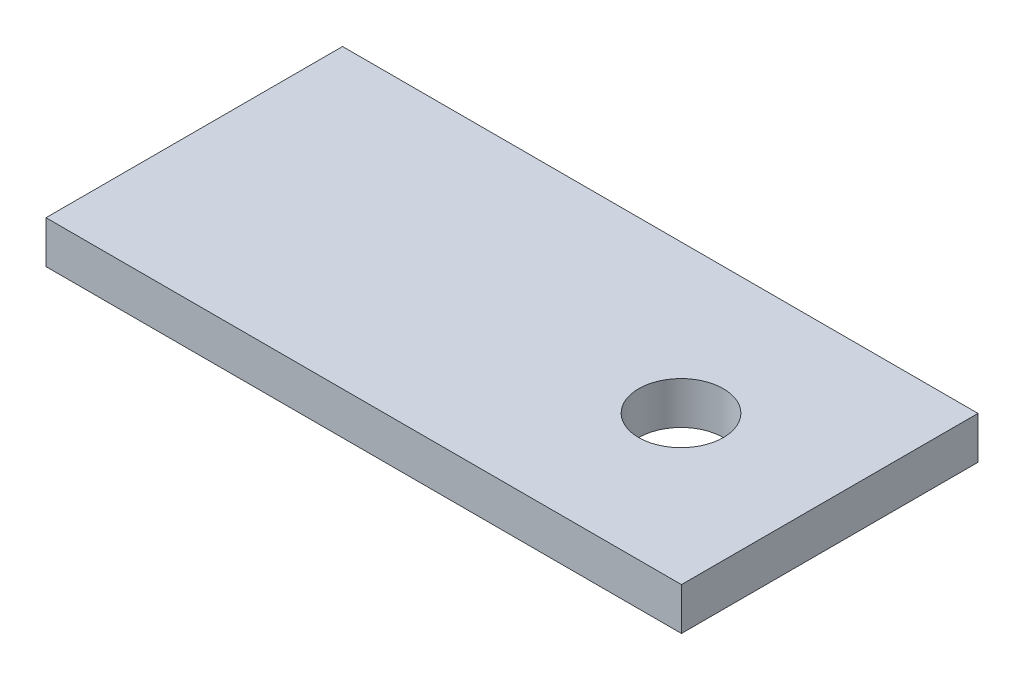
ISO-10303-21;
HEADER;
FILE_DESCRIPTION(('STEP AP214'),'2;1');
FILE_NAME('part.step','',(''),(''),'','','');
FILE_SCHEMA(('AUTOMOTIVE_DESIGN { 1 0 10303 214 1 1 1 1 }'));
ENDSEC;
DATA;
#1=APPLICATION_CONTEXT('core data for automotive mechanical design processes');
#2=APPLICATION_PROTOCOL_DEFINITION('international standard','automotive_design',2000,#1);
#3=PRODUCT_CONTEXT('',#1,'mechanical');
#4=PRODUCT('Part','Part','',(#3));
#5=PRODUCT_RELATED_PRODUCT_CATEGORY('part','',(#4));
#6=PRODUCT_DEFINITION_FORMATION('','',#4);
#7=PRODUCT_DEFINITION_CONTEXT('part definition',#1,'design');
#8=PRODUCT_DEFINITION('design','',#6,#7);
#9=PRODUCT_DEFINITION_SHAPE('','',#8);
#10=(LENGTH_UNIT() NAMED_UNIT(*) SI_UNIT(.MILLI.,.METRE.));
#11=(NAMED_UNIT(*) PLANE_ANGLE_UNIT() SI_UNIT($,.RADIAN.));
#12=(NAMED_UNIT(*) SI_UNIT($,.STERADIAN.) SOLID_ANGLE_UNIT());
#13=UNCERTAINTY_MEASURE_WITH_UNIT(LENGTH_MEASURE(1.E-05),#10,'distance_accuracy_value','');
#14=(GEOMETRIC_REPRESENTATION_CONTEXT(3) GLOBAL_UNCERTAINTY_ASSIGNED_CONTEXT((#13)) GLOBAL_UNIT_ASSIGNED_CONTEXT((#10,
#11,#12)) REPRESENTATION_CONTEXT('',''));
#15=CARTESIAN_POINT('',(0.,0.,0.));
#16=DIRECTION('',(0.,0.,1.));
#17=DIRECTION('',(1.,0.,0.));
#18=AXIS2_PLACEMENT_3D('',#15,#16,#17);
#19=CARTESIAN_POINT('',(0.,2.,0.));
#20=DIRECTION('',(-1.,0.,0.));
#21=DIRECTION('',(0.,0.,1.));
#22=AXIS2_PLACEMENT_3D('',#19,#20,#21);
#23=PLANE('',#22);
#24=DIRECTION('',(0.,0.,-1.));
#25=VECTOR('',#24,1.);
#26=CARTESIAN_POINT('',(0.,0.,0.));
#27=LINE('',#26,#25);
#28=CARTESIAN_POINT('',(0.,0.,0.));
#29=VERTEX_POINT('',#28);
#30=CARTESIAN_POINT('',(0.,0.,-14.));
#31=VERTEX_POINT('',#30);
#32=EDGE_CURVE('E101',#29,#31,#27,.T.);
#33=ORIENTED_EDGE('',*,*,#32,.T.);
#34=DIRECTION('',(0.,-1.,0.));
#35=VECTOR('',#34,1.);
#36=CARTESIAN_POINT('',(0.,2.,-14.));
#37=LINE('',#36,#35);
#38=CARTESIAN_POINT('',(0.,2.,-14.));
#39=VERTEX_POINT('',#38);
#40=EDGE_CURVE('E12',#39,#31,#37,.T.);
#41=ORIENTED_EDGE('',*,*,#40,.F.);
#42=DIRECTION('',(0.,0.,-1.));
#43=VECTOR('',#42,1.);
#44=CARTESIAN_POINT('',(0.,2.,0.));
#45=LINE('',#44,#43);
#46=CARTESIAN_POINT('',(0.,2.,0.));
#47=VERTEX_POINT('',#46);
#48=EDGE_CURVE('E85',#47,#39,#45,.T.);
#49=ORIENTED_EDGE('',*,*,#48,.F.);
#50=DIRECTION('',(0.,-1.,0.));
#51=VECTOR('',#50,1.);
#52=CARTESIAN_POINT('',(0.,2.,0.));
#53=LINE('',#52,#51);
#54=EDGE_CURVE('E97',#47,#29,#53,.T.);
#55=ORIENTED_EDGE('',*,*,#54,.T.);
#56=EDGE_LOOP('',(#33,#41,#49,#55));
#57=FACE_BOUND('',#56,.T.);
#58=ADVANCED_FACE('F37',(#57),#23,.F.);
#59=CARTESIAN_POINT('',(0.,2.,-14.));
#60=DIRECTION('',(0.,0.,1.));
#61=DIRECTION('',(1.,0.,0.));
#62=AXIS2_PLACEMENT_3D('',#59,#60,#61);
#63=PLANE('',#62);
#64=DIRECTION('',(-1.,0.,0.));
#65=VECTOR('',#64,1.);
#66=CARTESIAN_POINT('',(0.,0.,-14.));
#67=LINE('',#66,#65);
#68=CARTESIAN_POINT('',(-30.,0.,-14.));
#69=VERTEX_POINT('',#68);
#70=EDGE_CURVE('E90',#31,#69,#67,.T.);
#71=ORIENTED_EDGE('',*,*,#70,.T.);
#72=DIRECTION('',(0.,-1.,0.));
#73=VECTOR('',#72,1.);
#74=CARTESIAN_POINT('',(-30.,2.,-14.));
#75=LINE('',#74,#73);
#76=CARTESIAN_POINT('',(-30.,2.,-14.));
#77=VERTEX_POINT('',#76);
#78=EDGE_CURVE('E46',#77,#69,#75,.T.);
#79=ORIENTED_EDGE('',*,*,#78,.F.);
#80=DIRECTION('',(-1.,0.,0.));
#81=VECTOR('',#80,1.);
#82=CARTESIAN_POINT('',(0.,2.,-14.));
#83=LINE('',#82,#81);
#84=EDGE_CURVE('E80',#39,#77,#83,.T.);
#85=ORIENTED_EDGE('',*,*,#84,.F.);
#86=ORIENTED_EDGE('',*,*,#40,.T.);
#87=EDGE_LOOP('',(#71,#79,#85,#86));
#88=FACE_BOUND('',#87,.T.);
#89=ADVANCED_FACE('F89',(#88),#63,.F.);
#90=CARTESIAN_POINT('',(-30.,2.,0.));
#91=DIRECTION('',(-1.,0.,0.));
#92=DIRECTION('',(0.,0.,1.));
#93=AXIS2_PLACEMENT_3D('',#90,#91,#92);
#94=PLANE('',#93);
#95=DIRECTION('',(0.,0.,-1.));
#96=VECTOR('',#95,1.);
#97=CARTESIAN_POINT('',(-30.,0.,0.));
#98=LINE('',#97,#96);
#99=CARTESIAN_POINT('',(-30.,0.,0.));
#100=VERTEX_POINT('',#99);
#101=EDGE_CURVE('E105',#100,#69,#98,.T.);
#102=ORIENTED_EDGE('',*,*,#101,.F.);
#103=DIRECTION('',(0.,-1.,0.));
#104=VECTOR('',#103,1.);
#105=CARTESIAN_POINT('',(-30.,2.,0.));
#106=LINE('',#105,#104);
#107=CARTESIAN_POINT('',(-30.,2.,0.));
#108=VERTEX_POINT('',#107);
#109=EDGE_CURVE('E70',#108,#100,#106,.T.);
#110=ORIENTED_EDGE('',*,*,#109,.F.);
#111=DIRECTION('',(0.,0.,-1.));
#112=VECTOR('',#111,1.);
#113=CARTESIAN_POINT('',(-30.,2.,0.));
#114=LINE('',#113,#112);
#115=EDGE_CURVE('E83',#108,#77,#114,.T.);
#116=ORIENTED_EDGE('',*,*,#115,.T.);
#117=ORIENTED_EDGE('',*,*,#78,.T.);
#118=EDGE_LOOP('',(#102,#110,#116,#117));
#119=FACE_BOUND('',#118,.T.);
#120=ADVANCED_FACE('F95',(#119),#94,.T.);
#121=CARTESIAN_POINT('',(-30.,2.,0.));
#122=DIRECTION('',(0.,0.,-1.));
#123=DIRECTION('',(-1.,0.,0.));
#124=AXIS2_PLACEMENT_3D('',#121,#122,#123);
#125=PLANE('',#124);
#126=DIRECTION('',(1.,0.,0.));
#127=VECTOR('',#126,1.);
#128=CARTESIAN_POINT('',(-30.,0.,0.));
#129=LINE('',#128,#127);
#130=EDGE_CURVE('E73',#100,#29,#129,.T.);
#131=ORIENTED_EDGE('',*,*,#130,.T.);
#132=ORIENTED_EDGE('',*,*,#54,.F.);
#133=DIRECTION('',(1.,0.,0.));
#134=VECTOR('',#133,1.);
#135=CARTESIAN_POINT('',(-30.,2.,0.));
#136=LINE('',#135,#134);
#137=EDGE_CURVE('E54',#108,#47,#136,.T.);
#138=ORIENTED_EDGE('',*,*,#137,.F.);
#139=ORIENTED_EDGE('',*,*,#109,.T.);
#140=EDGE_LOOP('',(#131,#132,#138,#139));
#141=FACE_BOUND('',#140,.T.);
#142=ADVANCED_FACE('F123',(#141),#125,.F.);
#143=CARTESIAN_POINT('',(0.,2.,0.));
#144=DIRECTION('',(0.,1.,0.));
#145=DIRECTION('',(0.,0.,1.));
#146=AXIS2_PLACEMENT_3D('',#143,#144,#145);
#147=PLANE('',#146);
#148=CARTESIAN_POINT('',(-7.02037004457164,2.,-7.));
#149=DIRECTION('',(0.,1.,0.));
#150=DIRECTION('',(0.,0.,1.));
#151=AXIS2_PLACEMENT_3D('',#148,#149,#150);
#152=CIRCLE('',#151,2.);
#153=CARTESIAN_POINT('',(-7.02037004457164,2.,-5.));
#154=VERTEX_POINT('',#153);
#155=EDGE_CURVE('E175',#154,#154,#152,.T.);
#156=ORIENTED_EDGE('',*,*,#155,.F.);
#157=EDGE_LOOP('',(#156));
#158=FACE_BOUND('',#157,.T.);
#159=ORIENTED_EDGE('',*,*,#48,.T.);
#160=ORIENTED_EDGE('',*,*,#84,.T.);
#161=ORIENTED_EDGE('',*,*,#115,.F.);
#162=ORIENTED_EDGE('',*,*,#137,.T.);
#163=EDGE_LOOP('',(#159,#160,#161,#162));
#164=FACE_BOUND('',#163,.T.);
#165=ADVANCED_FACE('F81',(#158,#164),#147,.T.);
#166=CARTESIAN_POINT('',(0.,0.,0.));
#167=DIRECTION('',(0.,1.,0.));
#168=DIRECTION('',(0.,0.,1.));
#169=AXIS2_PLACEMENT_3D('',#166,#167,#168);
#170=PLANE('',#169);
#171=CARTESIAN_POINT('',(-7.02037004457164,0.,-7.));
#172=DIRECTION('',(0.,1.,0.));
#173=DIRECTION('',(0.,0.,1.));
#174=AXIS2_PLACEMENT_3D('',#171,#172,#173);
#175=CIRCLE('',#174,2.);
#176=CARTESIAN_POINT('',(-7.02037004457164,0.,-5.));
#177=VERTEX_POINT('',#176);
#178=EDGE_CURVE('E40',#177,#177,#175,.T.);
#179=ORIENTED_EDGE('',*,*,#178,.T.);
#180=EDGE_LOOP('',(#179));
#181=FACE_BOUND('',#180,.T.);
#182=ORIENTED_EDGE('',*,*,#32,.F.);
#183=ORIENTED_EDGE('',*,*,#130,.F.);
#184=ORIENTED_EDGE('',*,*,#101,.T.);
#185=ORIENTED_EDGE('',*,*,#70,.F.);
#186=EDGE_LOOP('',(#182,#183,#184,#185));
#187=FACE_BOUND('',#186,.T.);
#188=ADVANCED_FACE('F112',(#181,#187),#170,.F.);
#189=CARTESIAN_POINT('',(-7.02037004457164,-1.2E-05,-7.));
#190=DIRECTION('',(0.,1.,0.));
#191=DIRECTION('',(0.,0.,1.));
#192=AXIS2_PLACEMENT_3D('',#189,#190,#191);
#193=CYLINDRICAL_SURFACE('',#192,2.);
#194=ORIENTED_EDGE('',*,*,#155,.T.);
#195=EDGE_LOOP('',(#194));
#196=FACE_BOUND('',#195,.T.);
#197=ORIENTED_EDGE('',*,*,#178,.F.);
#198=EDGE_LOOP('',(#197));
#199=FACE_BOUND('',#198,.T.);
#200=ADVANCED_FACE('F114',(#196,#199),#193,.F.);
#201=CLOSED_SHELL('',(#58,#89,#120,#142,#165,#188,#200));
#202=MANIFOLD_SOLID_BREP('B2',#201);
#203=ADVANCED_BREP_SHAPE_REPRESENTATION('',(#18,#202),#14);
#204=SHAPE_DEFINITION_REPRESENTATION(#9,#203);
ENDSEC;
END-ISO-10303-21;
